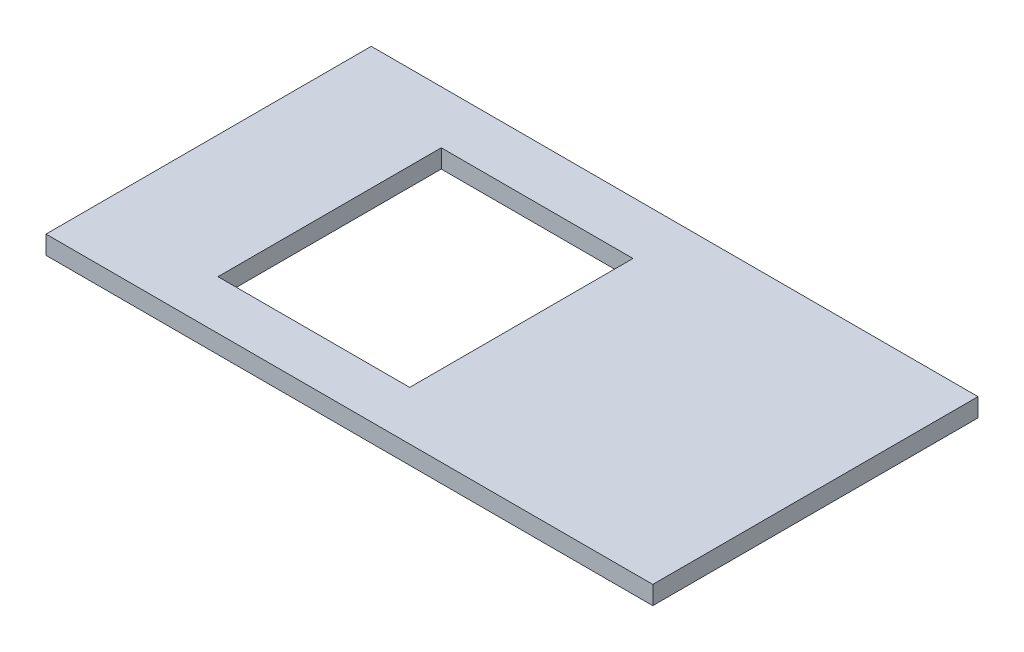
ISO-10303-21;
HEADER;
FILE_DESCRIPTION(('STEP AP214'),'2;1');
FILE_NAME('part.step','',(''),(''),'','','');
FILE_SCHEMA(('AUTOMOTIVE_DESIGN { 1 0 10303 214 1 1 1 1 }'));
ENDSEC;
DATA;
#1=APPLICATION_CONTEXT('core data for automotive mechanical design processes');
#2=APPLICATION_PROTOCOL_DEFINITION('international standard','automotive_design',2000,#1);
#3=PRODUCT_CONTEXT('',#1,'mechanical');
#4=PRODUCT('Part','Part','',(#3));
#5=PRODUCT_RELATED_PRODUCT_CATEGORY('part','',(#4));
#6=PRODUCT_DEFINITION_FORMATION('','',#4);
#7=PRODUCT_DEFINITION_CONTEXT('part definition',#1,'design');
#8=PRODUCT_DEFINITION('design','',#6,#7);
#9=PRODUCT_DEFINITION_SHAPE('','',#8);
#10=(LENGTH_UNIT() NAMED_UNIT(*) SI_UNIT(.MILLI.,.METRE.));
#11=(NAMED_UNIT(*) PLANE_ANGLE_UNIT() SI_UNIT($,.RADIAN.));
#12=(NAMED_UNIT(*) SI_UNIT($,.STERADIAN.) SOLID_ANGLE_UNIT());
#13=UNCERTAINTY_MEASURE_WITH_UNIT(LENGTH_MEASURE(1.E-05),#10,'distance_accuracy_value','');
#14=(GEOMETRIC_REPRESENTATION_CONTEXT(3) GLOBAL_UNCERTAINTY_ASSIGNED_CONTEXT((#13)) GLOBAL_UNIT_ASSIGNED_CONTEXT((#10,
#11,#12)) REPRESENTATION_CONTEXT('',''));
#15=CARTESIAN_POINT('',(0.,0.,0.));
#16=DIRECTION('',(0.,0.,1.));
#17=DIRECTION('',(1.,0.,0.));
#18=AXIS2_PLACEMENT_3D('',#15,#16,#17);
#19=CARTESIAN_POINT('',(1250.,38.,0.));
#20=DIRECTION('',(0.,0.,-1.));
#21=DIRECTION('',(-1.,0.,0.));
#22=AXIS2_PLACEMENT_3D('',#19,#20,#21);
#23=PLANE('',#22);
#24=DIRECTION('',(1.,0.,0.));
#25=VECTOR('',#24,1.);
#26=CARTESIAN_POINT('',(1250.,0.,0.));
#27=LINE('',#26,#25);
#28=CARTESIAN_POINT('',(0.,0.,0.));
#29=VERTEX_POINT('',#28);
#30=CARTESIAN_POINT('',(1250.,0.,0.));
#31=VERTEX_POINT('',#30);
#32=EDGE_CURVE('E133',#29,#31,#27,.T.);
#33=ORIENTED_EDGE('',*,*,#32,.T.);
#34=DIRECTION('',(0.,-1.,0.));
#35=VECTOR('',#34,1.);
#36=CARTESIAN_POINT('',(1250.,38.,0.));
#37=LINE('',#36,#35);
#38=CARTESIAN_POINT('',(1250.,38.,0.));
#39=VERTEX_POINT('',#38);
#40=EDGE_CURVE('E11',#39,#31,#37,.T.);
#41=ORIENTED_EDGE('',*,*,#40,.F.);
#42=DIRECTION('',(1.,0.,0.));
#43=VECTOR('',#42,1.);
#44=CARTESIAN_POINT('',(1250.,38.,0.));
#45=LINE('',#44,#43);
#46=CARTESIAN_POINT('',(0.,38.,0.));
#47=VERTEX_POINT('',#46);
#48=EDGE_CURVE('E137',#47,#39,#45,.T.);
#49=ORIENTED_EDGE('',*,*,#48,.F.);
#50=DIRECTION('',(0.,-1.,0.));
#51=VECTOR('',#50,1.);
#52=CARTESIAN_POINT('',(0.,38.,0.));
#53=LINE('',#52,#51);
#54=EDGE_CURVE('E147',#47,#29,#53,.T.);
#55=ORIENTED_EDGE('',*,*,#54,.T.);
#56=EDGE_LOOP('',(#33,#41,#49,#55));
#57=FACE_BOUND('',#56,.T.);
#58=ADVANCED_FACE('F36',(#57),#23,.F.);
#59=CARTESIAN_POINT('',(1250.,38.,-670.));
#60=DIRECTION('',(-1.,0.,0.));
#61=DIRECTION('',(0.,0.,1.));
#62=AXIS2_PLACEMENT_3D('',#59,#60,#61);
#63=PLANE('',#62);
#64=DIRECTION('',(0.,0.,-1.));
#65=VECTOR('',#64,1.);
#66=CARTESIAN_POINT('',(1250.,0.,-670.));
#67=LINE('',#66,#65);
#68=CARTESIAN_POINT('',(1250.,0.,-670.));
#69=VERTEX_POINT('',#68);
#70=EDGE_CURVE('E150',#31,#69,#67,.T.);
#71=ORIENTED_EDGE('',*,*,#70,.T.);
#72=DIRECTION('',(0.,-1.,0.));
#73=VECTOR('',#72,1.);
#74=CARTESIAN_POINT('',(1250.,38.,-670.));
#75=LINE('',#74,#73);
#76=CARTESIAN_POINT('',(1250.,38.,-670.));
#77=VERTEX_POINT('',#76);
#78=EDGE_CURVE('E43',#77,#69,#75,.T.);
#79=ORIENTED_EDGE('',*,*,#78,.F.);
#80=DIRECTION('',(0.,0.,-1.));
#81=VECTOR('',#80,1.);
#82=CARTESIAN_POINT('',(1250.,38.,-670.));
#83=LINE('',#82,#81);
#84=EDGE_CURVE('E140',#39,#77,#83,.T.);
#85=ORIENTED_EDGE('',*,*,#84,.F.);
#86=ORIENTED_EDGE('',*,*,#40,.T.);
#87=EDGE_LOOP('',(#71,#79,#85,#86));
#88=FACE_BOUND('',#87,.T.);
#89=ADVANCED_FACE('F178',(#88),#63,.F.);
#90=CARTESIAN_POINT('',(0.,38.,-670.));
#91=DIRECTION('',(0.,0.,1.));
#92=DIRECTION('',(1.,0.,0.));
#93=AXIS2_PLACEMENT_3D('',#90,#91,#92);
#94=PLANE('',#93);
#95=DIRECTION('',(-1.,0.,0.));
#96=VECTOR('',#95,1.);
#97=CARTESIAN_POINT('',(0.,0.,-670.));
#98=LINE('',#97,#96);
#99=CARTESIAN_POINT('',(0.,0.,-670.));
#100=VERTEX_POINT('',#99);
#101=EDGE_CURVE('E152',#69,#100,#98,.T.);
#102=ORIENTED_EDGE('',*,*,#101,.T.);
#103=DIRECTION('',(0.,-1.,0.));
#104=VECTOR('',#103,1.);
#105=CARTESIAN_POINT('',(0.,38.,-670.));
#106=LINE('',#105,#104);
#107=CARTESIAN_POINT('',(0.,38.,-670.));
#108=VERTEX_POINT('',#107);
#109=EDGE_CURVE('E157',#108,#100,#106,.T.);
#110=ORIENTED_EDGE('',*,*,#109,.F.);
#111=DIRECTION('',(-1.,0.,0.));
#112=VECTOR('',#111,1.);
#113=CARTESIAN_POINT('',(0.,38.,-670.));
#114=LINE('',#113,#112);
#115=EDGE_CURVE('E143',#77,#108,#114,.T.);
#116=ORIENTED_EDGE('',*,*,#115,.F.);
#117=ORIENTED_EDGE('',*,*,#78,.T.);
#118=EDGE_LOOP('',(#102,#110,#116,#117));
#119=FACE_BOUND('',#118,.T.);
#120=ADVANCED_FACE('F164',(#119),#94,.F.);
#121=CARTESIAN_POINT('',(0.,38.,0.));
#122=DIRECTION('',(1.,0.,0.));
#123=DIRECTION('',(0.,0.,-1.));
#124=AXIS2_PLACEMENT_3D('',#121,#122,#123);
#125=PLANE('',#124);
#126=DIRECTION('',(0.,0.,1.));
#127=VECTOR('',#126,1.);
#128=CARTESIAN_POINT('',(0.,0.,0.));
#129=LINE('',#128,#127);
#130=EDGE_CURVE('E141',#100,#29,#129,.T.);
#131=ORIENTED_EDGE('',*,*,#130,.T.);
#132=ORIENTED_EDGE('',*,*,#54,.F.);
#133=DIRECTION('',(0.,0.,1.));
#134=VECTOR('',#133,1.);
#135=CARTESIAN_POINT('',(0.,38.,0.));
#136=LINE('',#135,#134);
#137=EDGE_CURVE('E145',#108,#47,#136,.T.);
#138=ORIENTED_EDGE('',*,*,#137,.F.);
#139=ORIENTED_EDGE('',*,*,#109,.T.);
#140=EDGE_LOOP('',(#131,#132,#138,#139));
#141=FACE_BOUND('',#140,.T.);
#142=ADVANCED_FACE('F171',(#141),#125,.F.);
#143=CARTESIAN_POINT('',(0.,38.,0.));
#144=DIRECTION('',(0.,-1.,0.));
#145=DIRECTION('',(0.,0.,-1.));
#146=AXIS2_PLACEMENT_3D('',#143,#144,#145);
#147=PLANE('',#146);
#148=DIRECTION('',(1.,0.,0.));
#149=VECTOR('',#148,1.);
#150=CARTESIAN_POINT('',(253.155339667327,38.,-101.116391331439));
#151=LINE('',#150,#149);
#152=CARTESIAN_POINT('',(253.155339667327,38.,-101.116391331439));
#153=VERTEX_POINT('',#152);
#154=CARTESIAN_POINT('',(648.155339667327,38.,-101.116391331439));
#155=VERTEX_POINT('',#154);
#156=EDGE_CURVE('E127',#153,#155,#151,.T.);
#157=ORIENTED_EDGE('',*,*,#156,.F.);
#158=DIRECTION('',(0.,0.,1.));
#159=VECTOR('',#158,1.);
#160=CARTESIAN_POINT('',(253.155339667326,38.,-561.116391331439));
#161=LINE('',#160,#159);
#162=CARTESIAN_POINT('',(253.155339667326,38.,-561.116391331439));
#163=VERTEX_POINT('',#162);
#164=EDGE_CURVE('E50',#163,#153,#161,.T.);
#165=ORIENTED_EDGE('',*,*,#164,.F.);
#166=DIRECTION('',(-1.,0.,0.));
#167=VECTOR('',#166,1.);
#168=CARTESIAN_POINT('',(253.155339667326,38.,-561.116391331439));
#169=LINE('',#168,#167);
#170=CARTESIAN_POINT('',(648.155339667326,38.,-561.116391331439));
#171=VERTEX_POINT('',#170);
#172=EDGE_CURVE('E118',#171,#163,#169,.T.);
#173=ORIENTED_EDGE('',*,*,#172,.F.);
#174=DIRECTION('',(0.,0.,-1.));
#175=VECTOR('',#174,1.);
#176=CARTESIAN_POINT('',(648.155339667326,38.,-561.116391331439));
#177=LINE('',#176,#175);
#178=EDGE_CURVE('E121',#155,#171,#177,.T.);
#179=ORIENTED_EDGE('',*,*,#178,.F.);
#180=EDGE_LOOP('',(#157,#165,#173,#179));
#181=FACE_BOUND('',#180,.T.);
#182=ORIENTED_EDGE('',*,*,#48,.T.);
#183=ORIENTED_EDGE('',*,*,#84,.T.);
#184=ORIENTED_EDGE('',*,*,#115,.T.);
#185=ORIENTED_EDGE('',*,*,#137,.T.);
#186=EDGE_LOOP('',(#182,#183,#184,#185));
#187=FACE_BOUND('',#186,.T.);
#188=ADVANCED_FACE('F177',(#181,#187),#147,.F.);
#189=CARTESIAN_POINT('',(0.,0.,0.));
#190=DIRECTION('',(0.,-1.,0.));
#191=DIRECTION('',(0.,0.,-1.));
#192=AXIS2_PLACEMENT_3D('',#189,#190,#191);
#193=PLANE('',#192);
#194=DIRECTION('',(0.,0.,1.));
#195=VECTOR('',#194,1.);
#196=CARTESIAN_POINT('',(253.155339667326,0.,-561.116391331439));
#197=LINE('',#196,#195);
#198=CARTESIAN_POINT('',(253.155339667326,0.,-561.116391331439));
#199=VERTEX_POINT('',#198);
#200=CARTESIAN_POINT('',(253.155339667327,0.,-101.116391331439));
#201=VERTEX_POINT('',#200);
#202=EDGE_CURVE('E102',#199,#201,#197,.T.);
#203=ORIENTED_EDGE('',*,*,#202,.T.);
#204=DIRECTION('',(1.,0.,0.));
#205=VECTOR('',#204,1.);
#206=CARTESIAN_POINT('',(253.155339667327,0.,-101.116391331439));
#207=LINE('',#206,#205);
#208=CARTESIAN_POINT('',(648.155339667327,0.,-101.116391331439));
#209=VERTEX_POINT('',#208);
#210=EDGE_CURVE('E111',#201,#209,#207,.T.);
#211=ORIENTED_EDGE('',*,*,#210,.T.);
#212=DIRECTION('',(0.,0.,-1.));
#213=VECTOR('',#212,1.);
#214=CARTESIAN_POINT('',(648.155339667326,0.,-561.116391331439));
#215=LINE('',#214,#213);
#216=CARTESIAN_POINT('',(648.155339667326,0.,-561.116391331439));
#217=VERTEX_POINT('',#216);
#218=EDGE_CURVE('E58',#209,#217,#215,.T.);
#219=ORIENTED_EDGE('',*,*,#218,.T.);
#220=DIRECTION('',(-1.,0.,0.));
#221=VECTOR('',#220,1.);
#222=CARTESIAN_POINT('',(253.155339667326,0.,-561.116391331439));
#223=LINE('',#222,#221);
#224=EDGE_CURVE('E108',#217,#199,#223,.T.);
#225=ORIENTED_EDGE('',*,*,#224,.T.);
#226=EDGE_LOOP('',(#203,#211,#219,#225));
#227=FACE_BOUND('',#226,.T.);
#228=ORIENTED_EDGE('',*,*,#32,.F.);
#229=ORIENTED_EDGE('',*,*,#130,.F.);
#230=ORIENTED_EDGE('',*,*,#101,.F.);
#231=ORIENTED_EDGE('',*,*,#70,.F.);
#232=EDGE_LOOP('',(#228,#229,#230,#231));
#233=FACE_BOUND('',#232,.T.);
#234=ADVANCED_FACE('F115',(#227,#233),#193,.T.);
#235=CARTESIAN_POINT('',(253.155339667326,0.,-561.116391331439));
#236=DIRECTION('',(-1.,0.,0.));
#237=DIRECTION('',(0.,0.,1.));
#238=AXIS2_PLACEMENT_3D('',#235,#236,#237);
#239=PLANE('',#238);
#240=ORIENTED_EDGE('',*,*,#164,.T.);
#241=DIRECTION('',(0.,1.,0.));
#242=VECTOR('',#241,1.);
#243=CARTESIAN_POINT('',(253.155339667327,0.,-101.116391331439));
#244=LINE('',#243,#242);
#245=EDGE_CURVE('E98',#201,#153,#244,.T.);
#246=ORIENTED_EDGE('',*,*,#245,.F.);
#247=ORIENTED_EDGE('',*,*,#202,.F.);
#248=DIRECTION('',(0.,1.,0.));
#249=VECTOR('',#248,1.);
#250=CARTESIAN_POINT('',(253.155339667326,0.,-561.116391331439));
#251=LINE('',#250,#249);
#252=EDGE_CURVE('E131',#199,#163,#251,.T.);
#253=ORIENTED_EDGE('',*,*,#252,.T.);
#254=EDGE_LOOP('',(#240,#246,#247,#253));
#255=FACE_BOUND('',#254,.T.);
#256=ADVANCED_FACE('F100',(#255),#239,.F.);
#257=CARTESIAN_POINT('',(253.155339667326,0.,-561.116391331439));
#258=DIRECTION('',(0.,0.,-1.));
#259=DIRECTION('',(-1.,0.,0.));
#260=AXIS2_PLACEMENT_3D('',#257,#258,#259);
#261=PLANE('',#260);
#262=ORIENTED_EDGE('',*,*,#172,.T.);
#263=ORIENTED_EDGE('',*,*,#252,.F.);
#264=ORIENTED_EDGE('',*,*,#224,.F.);
#265=DIRECTION('',(0.,1.,0.));
#266=VECTOR('',#265,1.);
#267=CARTESIAN_POINT('',(648.155339667326,0.,-561.116391331439));
#268=LINE('',#267,#266);
#269=EDGE_CURVE('E134',#217,#171,#268,.T.);
#270=ORIENTED_EDGE('',*,*,#269,.T.);
#271=EDGE_LOOP('',(#262,#263,#264,#270));
#272=FACE_BOUND('',#271,.T.);
#273=ADVANCED_FACE('F195',(#272),#261,.F.);
#274=CARTESIAN_POINT('',(648.155339667326,0.,-561.116391331439));
#275=DIRECTION('',(1.,0.,0.));
#276=DIRECTION('',(0.,0.,-1.));
#277=AXIS2_PLACEMENT_3D('',#274,#275,#276);
#278=PLANE('',#277);
#279=ORIENTED_EDGE('',*,*,#178,.T.);
#280=ORIENTED_EDGE('',*,*,#269,.F.);
#281=ORIENTED_EDGE('',*,*,#218,.F.);
#282=DIRECTION('',(0.,1.,0.));
#283=VECTOR('',#282,1.);
#284=CARTESIAN_POINT('',(648.155339667327,0.,-101.116391331439));
#285=LINE('',#284,#283);
#286=EDGE_CURVE('E107',#209,#155,#285,.T.);
#287=ORIENTED_EDGE('',*,*,#286,.T.);
#288=EDGE_LOOP('',(#279,#280,#281,#287));
#289=FACE_BOUND('',#288,.T.);
#290=ADVANCED_FACE('F198',(#289),#278,.F.);
#291=CARTESIAN_POINT('',(253.155339667327,0.,-101.116391331439));
#292=DIRECTION('',(0.,0.,1.));
#293=DIRECTION('',(1.,0.,0.));
#294=AXIS2_PLACEMENT_3D('',#291,#292,#293);
#295=PLANE('',#294);
#296=ORIENTED_EDGE('',*,*,#156,.T.);
#297=ORIENTED_EDGE('',*,*,#286,.F.);
#298=ORIENTED_EDGE('',*,*,#210,.F.);
#299=ORIENTED_EDGE('',*,*,#245,.T.);
#300=EDGE_LOOP('',(#296,#297,#298,#299));
#301=FACE_BOUND('',#300,.T.);
#302=ADVANCED_FACE('F112',(#301),#295,.F.);
#303=CLOSED_SHELL('',(#58,#89,#120,#142,#188,#234,#256,#273,#290,#302));
#304=MANIFOLD_SOLID_BREP('B2',#303);
#305=ADVANCED_BREP_SHAPE_REPRESENTATION('',(#18,#304),#14);
#306=SHAPE_DEFINITION_REPRESENTATION(#9,#305);
ENDSEC;
END-ISO-10303-21;
